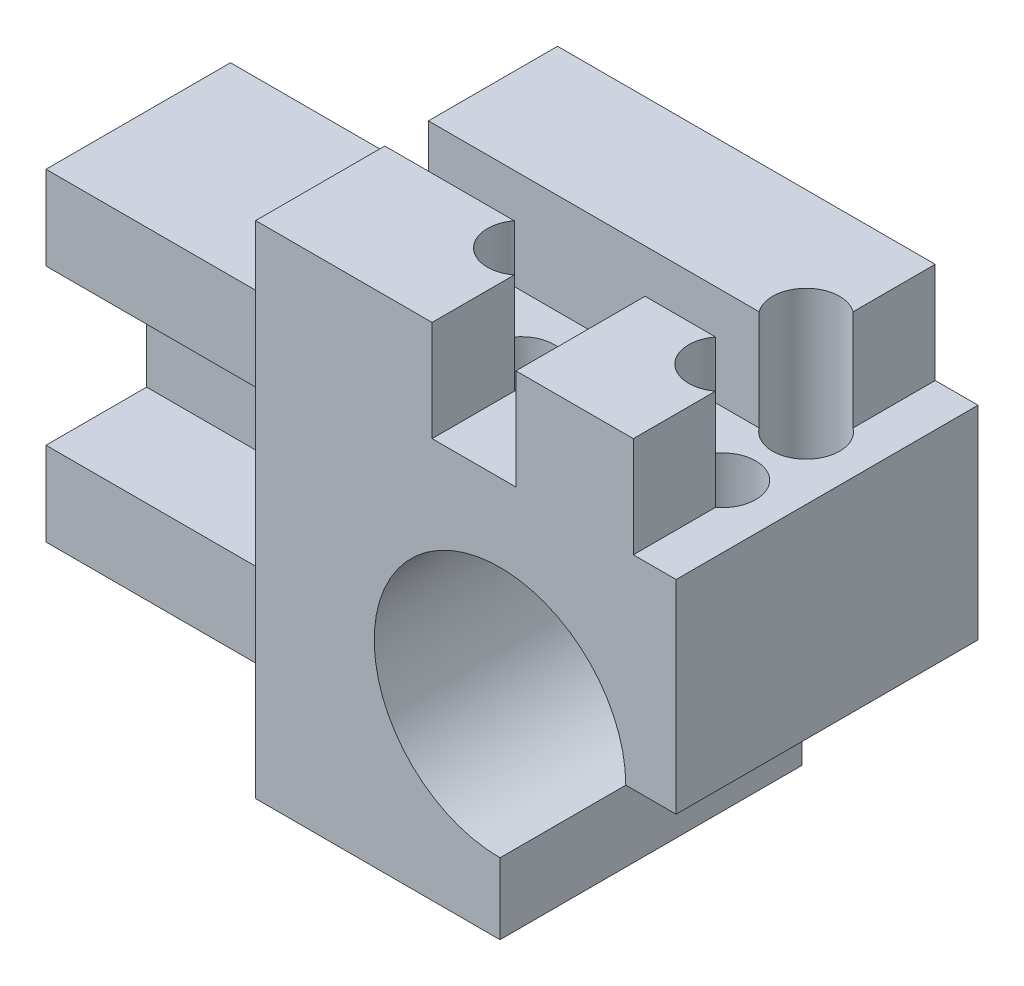
ISO-10303-21;
HEADER;
FILE_DESCRIPTION(('STEP AP214'),'2;1');
FILE_NAME('part.step','',(''),(''),'','','');
FILE_SCHEMA(('AUTOMOTIVE_DESIGN { 1 0 10303 214 1 1 1 1 }'));
ENDSEC;
DATA;
#1=APPLICATION_CONTEXT('core data for automotive mechanical design processes');
#2=APPLICATION_PROTOCOL_DEFINITION('international standard','automotive_design',2000,#1);
#3=PRODUCT_CONTEXT('',#1,'mechanical');
#4=PRODUCT('Part','Part','',(#3));
#5=PRODUCT_RELATED_PRODUCT_CATEGORY('part','',(#4));
#6=PRODUCT_DEFINITION_FORMATION('','',#4);
#7=PRODUCT_DEFINITION_CONTEXT('part definition',#1,'design');
#8=PRODUCT_DEFINITION('design','',#6,#7);
#9=PRODUCT_DEFINITION_SHAPE('','',#8);
#10=(LENGTH_UNIT() NAMED_UNIT(*) SI_UNIT(.MILLI.,.METRE.));
#11=(NAMED_UNIT(*) PLANE_ANGLE_UNIT() SI_UNIT($,.RADIAN.));
#12=(NAMED_UNIT(*) SI_UNIT($,.STERADIAN.) SOLID_ANGLE_UNIT());
#13=UNCERTAINTY_MEASURE_WITH_UNIT(LENGTH_MEASURE(1.E-05),#10,'distance_accuracy_value','');
#14=(GEOMETRIC_REPRESENTATION_CONTEXT(3) GLOBAL_UNCERTAINTY_ASSIGNED_CONTEXT((#13)) GLOBAL_UNIT_ASSIGNED_CONTEXT((#10,
#11,#12)) REPRESENTATION_CONTEXT('',''));
#15=CARTESIAN_POINT('',(0.,0.,0.));
#16=DIRECTION('',(0.,0.,1.));
#17=DIRECTION('',(1.,0.,0.));
#18=AXIS2_PLACEMENT_3D('',#15,#16,#17);
#19=CARTESIAN_POINT('',(-16.5,0.,9.));
#20=DIRECTION('',(1.,0.,0.));
#21=DIRECTION('',(0.,1.,0.));
#22=AXIS2_PLACEMENT_3D('',#19,#20,#21);
#23=PLANE('',#22);
#24=DIRECTION('',(0.,1.,0.));
#25=VECTOR('',#24,1.);
#26=CARTESIAN_POINT('',(-16.5,3.99999999999999,-1.3));
#27=LINE('',#26,#25);
#28=CARTESIAN_POINT('',(-16.5,3.99999999999999,-1.3));
#29=VERTEX_POINT('',#28);
#30=CARTESIAN_POINT('',(-16.5,9.99999999999999,-1.3));
#31=VERTEX_POINT('',#30);
#32=EDGE_CURVE('E358',#29,#31,#27,.T.);
#33=ORIENTED_EDGE('',*,*,#32,.T.);
#34=DIRECTION('',(0.,0.,-1.));
#35=VECTOR('',#34,1.);
#36=CARTESIAN_POINT('',(-16.5,9.99999999999999,9.));
#37=LINE('',#36,#35);
#38=CARTESIAN_POINT('',(-16.5,9.99999999999999,-9.));
#39=VERTEX_POINT('',#38);
#40=EDGE_CURVE('E571',#31,#39,#37,.T.);
#41=ORIENTED_EDGE('',*,*,#40,.T.);
#42=DIRECTION('',(0.,-1.,0.));
#43=VECTOR('',#42,1.);
#44=CARTESIAN_POINT('',(-16.5,0.,-9.));
#45=LINE('',#44,#43);
#46=CARTESIAN_POINT('',(-16.5,-0.600000000000005,-9.));
#47=VERTEX_POINT('',#46);
#48=EDGE_CURVE('E539',#39,#47,#45,.T.);
#49=ORIENTED_EDGE('',*,*,#48,.T.);
#50=DIRECTION('',(0.,0.,-1.));
#51=VECTOR('',#50,1.);
#52=CARTESIAN_POINT('',(-16.5,-0.600000000000005,-4.));
#53=LINE('',#52,#51);
#54=CARTESIAN_POINT('',(-16.5,-0.600000000000005,2.));
#55=VERTEX_POINT('',#54);
#56=EDGE_CURVE('E527',#55,#47,#53,.T.);
#57=ORIENTED_EDGE('',*,*,#56,.F.);
#58=DIRECTION('',(0.,1.,0.));
#59=VECTOR('',#58,1.);
#60=CARTESIAN_POINT('',(-16.5,-0.600000000000005,2.));
#61=LINE('',#60,#59);
#62=CARTESIAN_POINT('',(-16.5,-5.6,2.));
#63=VERTEX_POINT('',#62);
#64=EDGE_CURVE('E470',#63,#55,#61,.T.);
#65=ORIENTED_EDGE('',*,*,#64,.F.);
#66=DIRECTION('',(0.,0.,-1.));
#67=VECTOR('',#66,1.);
#68=CARTESIAN_POINT('',(-16.5,-5.6,2.));
#69=LINE('',#68,#67);
#70=CARTESIAN_POINT('',(-16.5,-5.6,-4.));
#71=VERTEX_POINT('',#70);
#72=EDGE_CURVE('E478',#63,#71,#69,.T.);
#73=ORIENTED_EDGE('',*,*,#72,.T.);
#74=DIRECTION('',(0.,-1.,0.));
#75=VECTOR('',#74,1.);
#76=CARTESIAN_POINT('',(-16.5,-19.85,-4.));
#77=LINE('',#76,#75);
#78=CARTESIAN_POINT('',(-16.5,-14.85,-4.));
#79=VERTEX_POINT('',#78);
#80=EDGE_CURVE('E512',#71,#79,#77,.T.);
#81=ORIENTED_EDGE('',*,*,#80,.T.);
#82=DIRECTION('',(0.,0.,-1.));
#83=VECTOR('',#82,1.);
#84=CARTESIAN_POINT('',(-16.5,-14.85,2.));
#85=LINE('',#84,#83);
#86=CARTESIAN_POINT('',(-16.5,-14.85,2.));
#87=VERTEX_POINT('',#86);
#88=EDGE_CURVE('E507',#87,#79,#85,.T.);
#89=ORIENTED_EDGE('',*,*,#88,.F.);
#90=DIRECTION('',(0.,1.,0.));
#91=VECTOR('',#90,1.);
#92=CARTESIAN_POINT('',(-16.5,-19.85,2.));
#93=LINE('',#92,#91);
#94=CARTESIAN_POINT('',(-16.5,-19.85,2.));
#95=VERTEX_POINT('',#94);
#96=EDGE_CURVE('E495',#95,#87,#93,.T.);
#97=ORIENTED_EDGE('',*,*,#96,.F.);
#98=DIRECTION('',(0.,0.,-1.));
#99=VECTOR('',#98,1.);
#100=CARTESIAN_POINT('',(-16.5,-19.85,9.));
#101=LINE('',#100,#99);
#102=CARTESIAN_POINT('',(-16.5,-19.85,9.));
#103=VERTEX_POINT('',#102);
#104=EDGE_CURVE('E551',#103,#95,#101,.T.);
#105=ORIENTED_EDGE('',*,*,#104,.F.);
#106=DIRECTION('',(0.,-1.,0.));
#107=VECTOR('',#106,1.);
#108=CARTESIAN_POINT('',(-16.5,0.,9.));
#109=LINE('',#108,#107);
#110=CARTESIAN_POINT('',(-16.5,9.99999999999999,9.));
#111=VERTEX_POINT('',#110);
#112=EDGE_CURVE('E548',#111,#103,#109,.T.);
#113=ORIENTED_EDGE('',*,*,#112,.F.);
#114=CARTESIAN_POINT('',(-16.5,9.99999999999999,1.3));
#115=VERTEX_POINT('',#114);
#116=EDGE_CURVE('E572',#111,#115,#37,.T.);
#117=ORIENTED_EDGE('',*,*,#116,.T.);
#118=DIRECTION('',(0.,1.,0.));
#119=VECTOR('',#118,1.);
#120=CARTESIAN_POINT('',(-16.5,3.99999999999999,1.3));
#121=LINE('',#120,#119);
#122=CARTESIAN_POINT('',(-16.5,3.99999999999999,1.3));
#123=VERTEX_POINT('',#122);
#124=EDGE_CURVE('E409',#123,#115,#121,.T.);
#125=ORIENTED_EDGE('',*,*,#124,.F.);
#126=DIRECTION('',(0.,0.,1.));
#127=VECTOR('',#126,1.);
#128=CARTESIAN_POINT('',(-16.5,3.99999999999999,0.));
#129=LINE('',#128,#127);
#130=EDGE_CURVE('E319',#29,#123,#129,.T.);
#131=ORIENTED_EDGE('',*,*,#130,.F.);
#132=EDGE_LOOP('',(#33,#41,#49,#57,#65,#73,#81,#89,#97,#105,#113,#117,#125,#131));
#133=FACE_BOUND('',#132,.T.);
#134=ADVANCED_FACE('F43',(#133),#23,.F.);
#135=CARTESIAN_POINT('',(8.56892000000005,0.,9.));
#136=DIRECTION('',(-1.,0.,0.));
#137=DIRECTION('',(0.,-1.,0.));
#138=AXIS2_PLACEMENT_3D('',#135,#136,#137);
#139=PLANE('',#138);
#140=DIRECTION('',(0.,0.,-1.));
#141=VECTOR('',#140,1.);
#142=CARTESIAN_POINT('',(8.56892000000006,4.,0.));
#143=LINE('',#142,#141);
#144=CARTESIAN_POINT('',(8.56892000000006,4.,9.));
#145=VERTEX_POINT('',#144);
#146=CARTESIAN_POINT('',(8.56892000000006,4.,-9.));
#147=VERTEX_POINT('',#146);
#148=EDGE_CURVE('E348',#145,#147,#143,.T.);
#149=ORIENTED_EDGE('',*,*,#148,.F.);
#150=DIRECTION('',(0.,1.,0.));
#151=VECTOR('',#150,1.);
#152=CARTESIAN_POINT('',(8.56892000000005,0.,9.));
#153=LINE('',#152,#151);
#154=CARTESIAN_POINT('',(8.56892000000005,-8.11891999999998,9.));
#155=VERTEX_POINT('',#154);
#156=EDGE_CURVE('E541',#155,#145,#153,.T.);
#157=ORIENTED_EDGE('',*,*,#156,.F.);
#158=DIRECTION('',(0.,0.,-1.));
#159=VECTOR('',#158,1.);
#160=CARTESIAN_POINT('',(8.56892000000005,-8.11891999999998,9.));
#161=LINE('',#160,#159);
#162=CARTESIAN_POINT('',(8.56892000000005,-8.11891999999998,-9.));
#163=VERTEX_POINT('',#162);
#164=EDGE_CURVE('E576',#155,#163,#161,.T.);
#165=ORIENTED_EDGE('',*,*,#164,.T.);
#166=DIRECTION('',(0.,1.,0.));
#167=VECTOR('',#166,1.);
#168=CARTESIAN_POINT('',(8.56892000000005,0.,-9.));
#169=LINE('',#168,#167);
#170=EDGE_CURVE('E558',#163,#147,#169,.T.);
#171=ORIENTED_EDGE('',*,*,#170,.T.);
#172=EDGE_LOOP('',(#149,#157,#165,#171));
#173=FACE_BOUND('',#172,.T.);
#174=ADVANCED_FACE('F622',(#173),#139,.F.);
#175=CARTESIAN_POINT('',(0.,10.,9.));
#176=DIRECTION('',(0.,-1.,0.));
#177=DIRECTION('',(1.,0.,0.));
#178=AXIS2_PLACEMENT_3D('',#175,#176,#177);
#179=PLANE('',#178);
#180=DIRECTION('',(1.,0.,0.));
#181=VECTOR('',#180,1.);
#182=CARTESIAN_POINT('',(0.,10.,-1.3));
#183=LINE('',#182,#181);
#184=CARTESIAN_POINT('',(3.21892000000001,10.,-1.3));
#185=VERTEX_POINT('',#184);
#186=EDGE_CURVE('E313',#31,#185,#183,.T.);
#187=ORIENTED_EDGE('',*,*,#186,.T.);
#188=CARTESIAN_POINT('',(4.81892000000001,10.,-2.5));
#189=DIRECTION('',(0.,1.,0.));
#190=DIRECTION('',(-1.,0.,0.));
#191=AXIS2_PLACEMENT_3D('',#188,#189,#190);
#192=CIRCLE('',#191,2.);
#193=CARTESIAN_POINT('',(6.01892,10.,-4.1));
#194=VERTEX_POINT('',#193);
#195=EDGE_CURVE('E427',#194,#185,#192,.T.);
#196=ORIENTED_EDGE('',*,*,#195,.F.);
#197=DIRECTION('',(0.,0.,-1.));
#198=VECTOR('',#197,1.);
#199=CARTESIAN_POINT('',(6.01892000000001,10.,0.));
#200=LINE('',#199,#198);
#201=CARTESIAN_POINT('',(6.01892,10.,-9.));
#202=VERTEX_POINT('',#201);
#203=EDGE_CURVE('E320',#194,#202,#200,.T.);
#204=ORIENTED_EDGE('',*,*,#203,.T.);
#205=DIRECTION('',(-1.,0.,0.));
#206=VECTOR('',#205,1.);
#207=CARTESIAN_POINT('',(0.,10.,-9.));
#208=LINE('',#207,#206);
#209=EDGE_CURVE('E561',#202,#39,#208,.T.);
#210=ORIENTED_EDGE('',*,*,#209,.T.);
#211=ORIENTED_EDGE('',*,*,#40,.F.);
#212=EDGE_LOOP('',(#187,#196,#204,#210,#211));
#213=FACE_BOUND('',#212,.T.);
#214=ADVANCED_FACE('F628',(#213),#179,.F.);
#215=DIRECTION('',(0.,0.,-1.));
#216=VECTOR('',#215,1.);
#217=CARTESIAN_POINT('',(6.01892000000001,10.,0.));
#218=LINE('',#217,#216);
#219=CARTESIAN_POINT('',(6.01892,10.,9.));
#220=VERTEX_POINT('',#219);
#221=CARTESIAN_POINT('',(6.01892,10.,4.1));
#222=VERTEX_POINT('',#221);
#223=EDGE_CURVE('E373',#220,#222,#218,.T.);
#224=ORIENTED_EDGE('',*,*,#223,.T.);
#225=CARTESIAN_POINT('',(4.81892000000001,10.,2.5));
#226=DIRECTION('',(0.,1.,0.));
#227=DIRECTION('',(-1.,0.,0.));
#228=AXIS2_PLACEMENT_3D('',#225,#226,#227);
#229=CIRCLE('',#228,2.);
#230=CARTESIAN_POINT('',(3.21892000000001,10.,1.3));
#231=VERTEX_POINT('',#230);
#232=EDGE_CURVE('E380',#231,#222,#229,.T.);
#233=ORIENTED_EDGE('',*,*,#232,.F.);
#234=DIRECTION('',(1.,0.,0.));
#235=VECTOR('',#234,1.);
#236=CARTESIAN_POINT('',(0.,10.,1.3));
#237=LINE('',#236,#235);
#238=CARTESIAN_POINT('',(-0.981079999999992,10.,1.3));
#239=VERTEX_POINT('',#238);
#240=EDGE_CURVE('E371',#239,#231,#237,.T.);
#241=ORIENTED_EDGE('',*,*,#240,.F.);
#242=DIRECTION('',(0.,0.,-1.));
#243=VECTOR('',#242,1.);
#244=CARTESIAN_POINT('',(-0.981079999999992,10.,0.));
#245=LINE('',#244,#243);
#246=CARTESIAN_POINT('',(-0.981079999999994,10.,9.));
#247=VERTEX_POINT('',#246);
#248=EDGE_CURVE('E368',#247,#239,#245,.T.);
#249=ORIENTED_EDGE('',*,*,#248,.F.);
#250=DIRECTION('',(-1.,0.,0.));
#251=VECTOR('',#250,1.);
#252=CARTESIAN_POINT('',(0.,10.,9.));
#253=LINE('',#252,#251);
#254=EDGE_CURVE('E547',#220,#247,#253,.T.);
#255=ORIENTED_EDGE('',*,*,#254,.F.);
#256=EDGE_LOOP('',(#224,#233,#241,#249,#255));
#257=FACE_BOUND('',#256,.T.);
#258=ADVANCED_FACE('F639',(#257),#179,.F.);
#259=CARTESIAN_POINT('',(0.,0.,9.));
#260=DIRECTION('',(0.,0.,1.));
#261=DIRECTION('',(1.,0.,0.));
#262=AXIS2_PLACEMENT_3D('',#259,#260,#261);
#263=PLANE('',#262);
#264=CARTESIAN_POINT('',(-1.93107999999995,-8.11892000000002,9.));
#265=DIRECTION('',(0.,0.,1.));
#266=DIRECTION('',(1.,0.,0.));
#267=AXIS2_PLACEMENT_3D('',#264,#265,#266);
#268=CIRCLE('',#267,7.5);
#269=CARTESIAN_POINT('',(5.56892000000005,-8.11892000000002,9.));
#270=VERTEX_POINT('',#269);
#271=CARTESIAN_POINT('',(-1.93107999999995,-15.61892,9.));
#272=VERTEX_POINT('',#271);
#273=EDGE_CURVE('E294',#270,#272,#268,.T.);
#274=ORIENTED_EDGE('',*,*,#273,.F.);
#275=DIRECTION('',(-1.,0.,0.));
#276=VECTOR('',#275,1.);
#277=CARTESIAN_POINT('',(0.,-8.11891999999998,9.));
#278=LINE('',#277,#276);
#279=EDGE_CURVE('E538',#155,#270,#278,.T.);
#280=ORIENTED_EDGE('',*,*,#279,.F.);
#281=ORIENTED_EDGE('',*,*,#156,.T.);
#282=DIRECTION('',(1.,0.,0.));
#283=VECTOR('',#282,1.);
#284=CARTESIAN_POINT('',(0.,4.,9.));
#285=LINE('',#284,#283);
#286=CARTESIAN_POINT('',(6.01892,4.,9.));
#287=VERTEX_POINT('',#286);
#288=EDGE_CURVE('E337',#287,#145,#285,.T.);
#289=ORIENTED_EDGE('',*,*,#288,.F.);
#290=DIRECTION('',(0.,1.,0.));
#291=VECTOR('',#290,1.);
#292=CARTESIAN_POINT('',(6.01892,4.,9.));
#293=LINE('',#292,#291);
#294=EDGE_CURVE('E386',#287,#220,#293,.T.);
#295=ORIENTED_EDGE('',*,*,#294,.T.);
#296=ORIENTED_EDGE('',*,*,#254,.T.);
#297=DIRECTION('',(0.,1.,0.));
#298=VECTOR('',#297,1.);
#299=CARTESIAN_POINT('',(-0.981079999999993,4.,9.));
#300=LINE('',#299,#298);
#301=CARTESIAN_POINT('',(-0.981079999999993,4.,9.));
#302=VERTEX_POINT('',#301);
#303=EDGE_CURVE('E396',#302,#247,#300,.T.);
#304=ORIENTED_EDGE('',*,*,#303,.F.);
#305=CARTESIAN_POINT('',(-5.98107999999999,4.,9.));
#306=VERTEX_POINT('',#305);
#307=EDGE_CURVE('E332',#306,#302,#285,.T.);
#308=ORIENTED_EDGE('',*,*,#307,.F.);
#309=DIRECTION('',(0.,1.,0.));
#310=VECTOR('',#309,1.);
#311=CARTESIAN_POINT('',(-5.98107999999999,4.,9.));
#312=LINE('',#311,#310);
#313=CARTESIAN_POINT('',(-5.98107999999999,10.,9.));
#314=VERTEX_POINT('',#313);
#315=EDGE_CURVE('E398',#306,#314,#312,.T.);
#316=ORIENTED_EDGE('',*,*,#315,.T.);
#317=EDGE_CURVE('E544',#314,#111,#253,.T.);
#318=ORIENTED_EDGE('',*,*,#317,.T.);
#319=ORIENTED_EDGE('',*,*,#112,.T.);
#320=DIRECTION('',(1.,0.,0.));
#321=VECTOR('',#320,1.);
#322=CARTESIAN_POINT('',(0.,-19.85,9.));
#323=LINE('',#322,#321);
#324=CARTESIAN_POINT('',(-1.93107999999995,-19.85,9.));
#325=VERTEX_POINT('',#324);
#326=EDGE_CURVE('E305',#103,#325,#323,.T.);
#327=ORIENTED_EDGE('',*,*,#326,.T.);
#328=DIRECTION('',(0.,-1.,0.));
#329=VECTOR('',#328,1.);
#330=CARTESIAN_POINT('',(-1.93107999999995,0.,9.));
#331=LINE('',#330,#329);
#332=EDGE_CURVE('E286',#272,#325,#331,.T.);
#333=ORIENTED_EDGE('',*,*,#332,.F.);
#334=EDGE_LOOP('',(#274,#280,#281,#289,#295,#296,#304,#308,#316,#318,#319,#327,#333));
#335=FACE_BOUND('',#334,.T.);
#336=ADVANCED_FACE('F303',(#335),#263,.T.);
#337=CARTESIAN_POINT('',(0.,0.,-9.));
#338=DIRECTION('',(0.,0.,1.));
#339=DIRECTION('',(1.,0.,0.));
#340=AXIS2_PLACEMENT_3D('',#337,#338,#339);
#341=PLANE('',#340);
#342=DIRECTION('',(-1.,0.,0.));
#343=VECTOR('',#342,1.);
#344=CARTESIAN_POINT('',(0.,-8.475,-9.));
#345=LINE('',#344,#343);
#346=CARTESIAN_POINT('',(-26.,-8.475,-9.));
#347=VERTEX_POINT('',#346);
#348=CARTESIAN_POINT('',(-28.,-8.475,-9.));
#349=VERTEX_POINT('',#348);
#350=EDGE_CURVE('E52',#347,#349,#345,.T.);
#351=ORIENTED_EDGE('',*,*,#350,.T.);
#352=CARTESIAN_POINT('',(-28.,-10.225,-9.));
#353=DIRECTION('',(0.,0.,1.));
#354=DIRECTION('',(1.,0.,0.));
#355=AXIS2_PLACEMENT_3D('',#352,#353,#354);
#356=CIRCLE('',#355,1.75);
#357=CARTESIAN_POINT('',(-28.,-11.975,-9.));
#358=VERTEX_POINT('',#357);
#359=EDGE_CURVE('E11',#349,#358,#356,.T.);
#360=ORIENTED_EDGE('',*,*,#359,.T.);
#361=DIRECTION('',(1.,0.,0.));
#362=VECTOR('',#361,1.);
#363=CARTESIAN_POINT('',(0.,-11.975,-9.));
#364=LINE('',#363,#362);
#365=CARTESIAN_POINT('',(-26.,-11.975,-9.));
#366=VERTEX_POINT('',#365);
#367=EDGE_CURVE('E578',#358,#366,#364,.T.);
#368=ORIENTED_EDGE('',*,*,#367,.T.);
#369=CARTESIAN_POINT('',(-26.,-10.225,-9.));
#370=DIRECTION('',(0.,0.,1.));
#371=DIRECTION('',(1.,0.,0.));
#372=AXIS2_PLACEMENT_3D('',#369,#370,#371);
#373=CIRCLE('',#372,1.75);
#374=EDGE_CURVE('E582',#366,#347,#373,.T.);
#375=ORIENTED_EDGE('',*,*,#374,.T.);
#376=EDGE_LOOP('',(#351,#360,#368,#375));
#377=FACE_BOUND('',#376,.T.);
#378=DIRECTION('',(-1.,0.,0.));
#379=VECTOR('',#378,1.);
#380=CARTESIAN_POINT('',(0.,-8.11891999999998,-9.));
#381=LINE('',#380,#379);
#382=CARTESIAN_POINT('',(5.56892000000005,-8.11891999999998,-9.));
#383=VERTEX_POINT('',#382);
#384=EDGE_CURVE('E555',#163,#383,#381,.T.);
#385=ORIENTED_EDGE('',*,*,#384,.T.);
#386=CARTESIAN_POINT('',(-1.93107999999995,-8.11892000000002,-9.));
#387=DIRECTION('',(0.,0.,1.));
#388=DIRECTION('',(1.,0.,0.));
#389=AXIS2_PLACEMENT_3D('',#386,#387,#388);
#390=CIRCLE('',#389,7.5);
#391=CARTESIAN_POINT('',(-1.93107999999995,-15.61892,-9.));
#392=VERTEX_POINT('',#391);
#393=EDGE_CURVE('E59',#383,#392,#390,.T.);
#394=ORIENTED_EDGE('',*,*,#393,.T.);
#395=DIRECTION('',(0.,-1.,0.));
#396=VECTOR('',#395,1.);
#397=CARTESIAN_POINT('',(-1.93107999999995,0.,-9.));
#398=LINE('',#397,#396);
#399=CARTESIAN_POINT('',(-1.93107999999995,-19.85,-9.));
#400=VERTEX_POINT('',#399);
#401=EDGE_CURVE('E289',#392,#400,#398,.T.);
#402=ORIENTED_EDGE('',*,*,#401,.T.);
#403=DIRECTION('',(1.,0.,0.));
#404=VECTOR('',#403,1.);
#405=CARTESIAN_POINT('',(0.,-19.85,-9.));
#406=LINE('',#405,#404);
#407=CARTESIAN_POINT('',(-36.,-19.85,-9.));
#408=VERTEX_POINT('',#407);
#409=EDGE_CURVE('E530',#408,#400,#406,.T.);
#410=ORIENTED_EDGE('',*,*,#409,.F.);
#411=DIRECTION('',(0.,1.,0.));
#412=VECTOR('',#411,1.);
#413=CARTESIAN_POINT('',(-36.,-19.85,-9.));
#414=LINE('',#413,#412);
#415=CARTESIAN_POINT('',(-36.,-0.600000000000005,-9.));
#416=VERTEX_POINT('',#415);
#417=EDGE_CURVE('E511',#408,#416,#414,.T.);
#418=ORIENTED_EDGE('',*,*,#417,.T.);
#419=DIRECTION('',(1.,0.,0.));
#420=VECTOR('',#419,1.);
#421=CARTESIAN_POINT('',(-16.5,-0.600000000000005,-9.));
#422=LINE('',#421,#420);
#423=EDGE_CURVE('E516',#416,#47,#422,.T.);
#424=ORIENTED_EDGE('',*,*,#423,.T.);
#425=ORIENTED_EDGE('',*,*,#48,.F.);
#426=ORIENTED_EDGE('',*,*,#209,.F.);
#427=DIRECTION('',(0.,1.,0.));
#428=VECTOR('',#427,1.);
#429=CARTESIAN_POINT('',(6.01892,4.,-9.));
#430=LINE('',#429,#428);
#431=CARTESIAN_POINT('',(6.01892,4.,-9.));
#432=VERTEX_POINT('',#431);
#433=EDGE_CURVE('E384',#432,#202,#430,.T.);
#434=ORIENTED_EDGE('',*,*,#433,.F.);
#435=DIRECTION('',(-1.,0.,0.));
#436=VECTOR('',#435,1.);
#437=CARTESIAN_POINT('',(0.,4.,-9.));
#438=LINE('',#437,#436);
#439=EDGE_CURVE('E350',#147,#432,#438,.T.);
#440=ORIENTED_EDGE('',*,*,#439,.F.);
#441=ORIENTED_EDGE('',*,*,#170,.F.);
#442=EDGE_LOOP('',(#385,#394,#402,#410,#418,#424,#425,#426,#434,#440,#441));
#443=FACE_BOUND('',#442,.T.);
#444=ADVANCED_FACE('F588',(#377,#443),#341,.F.);
#445=CARTESIAN_POINT('',(4.81892000000001,0.,2.5));
#446=DIRECTION('',(0.,1.,0.));
#447=DIRECTION('',(-1.,0.,0.));
#448=AXIS2_PLACEMENT_3D('',#445,#446,#447);
#449=CYLINDRICAL_SURFACE('',#448,2.);
#450=CARTESIAN_POINT('',(4.81892000000001,0.,2.5));
#451=DIRECTION('',(0.,1.,0.));
#452=DIRECTION('',(-1.,0.,0.));
#453=AXIS2_PLACEMENT_3D('',#450,#451,#452);
#454=CIRCLE('',#453,2.);
#455=CARTESIAN_POINT('',(2.81892000000001,0.,2.5));
#456=VERTEX_POINT('',#455);
#457=EDGE_CURVE('E430',#456,#456,#454,.T.);
#458=ORIENTED_EDGE('',*,*,#457,.F.);
#459=EDGE_LOOP('',(#458));
#460=FACE_BOUND('',#459,.T.);
#461=DIRECTION('',(0.,1.,0.));
#462=VECTOR('',#461,1.);
#463=CARTESIAN_POINT('',(6.01892000000001,4.,4.1));
#464=LINE('',#463,#462);
#465=CARTESIAN_POINT('',(6.01892000000001,4.,4.1));
#466=VERTEX_POINT('',#465);
#467=EDGE_CURVE('E389',#466,#222,#464,.T.);
#468=ORIENTED_EDGE('',*,*,#467,.F.);
#469=CARTESIAN_POINT('',(4.81892000000001,4.,2.5));
#470=DIRECTION('',(0.,1.,0.));
#471=DIRECTION('',(-1.,0.,0.));
#472=AXIS2_PLACEMENT_3D('',#469,#470,#471);
#473=CIRCLE('',#472,2.);
#474=CARTESIAN_POINT('',(3.21892000000001,4.,1.3));
#475=VERTEX_POINT('',#474);
#476=EDGE_CURVE('E343',#475,#466,#473,.F.);
#477=ORIENTED_EDGE('',*,*,#476,.F.);
#478=DIRECTION('',(0.,1.,0.));
#479=VECTOR('',#478,1.);
#480=CARTESIAN_POINT('',(3.21892000000001,4.,1.3));
#481=LINE('',#480,#479);
#482=EDGE_CURVE('E391',#475,#231,#481,.T.);
#483=ORIENTED_EDGE('',*,*,#482,.T.);
#484=ORIENTED_EDGE('',*,*,#232,.T.);
#485=EDGE_LOOP('',(#468,#477,#483,#484));
#486=FACE_BOUND('',#485,.T.);
#487=ADVANCED_FACE('F667',(#460,#486),#449,.F.);
#488=CARTESIAN_POINT('',(4.81892000000001,0.,-2.5));
#489=DIRECTION('',(0.,1.,0.));
#490=DIRECTION('',(-1.,0.,0.));
#491=AXIS2_PLACEMENT_3D('',#488,#489,#490);
#492=CYLINDRICAL_SURFACE('',#491,2.);
#493=CARTESIAN_POINT('',(4.81892000000001,0.,-2.5));
#494=DIRECTION('',(0.,1.,0.));
#495=DIRECTION('',(-1.,0.,0.));
#496=AXIS2_PLACEMENT_3D('',#493,#494,#495);
#497=CIRCLE('',#496,2.);
#498=CARTESIAN_POINT('',(2.81892000000001,0.,-2.5));
#499=VERTEX_POINT('',#498);
#500=EDGE_CURVE('E424',#499,#499,#497,.T.);
#501=ORIENTED_EDGE('',*,*,#500,.F.);
#502=EDGE_LOOP('',(#501));
#503=FACE_BOUND('',#502,.T.);
#504=DIRECTION('',(0.,1.,0.));
#505=VECTOR('',#504,1.);
#506=CARTESIAN_POINT('',(3.21892000000001,4.,-1.3));
#507=LINE('',#506,#505);
#508=CARTESIAN_POINT('',(3.21892000000001,4.,-1.3));
#509=VERTEX_POINT('',#508);
#510=EDGE_CURVE('E378',#509,#185,#507,.T.);
#511=ORIENTED_EDGE('',*,*,#510,.F.);
#512=CARTESIAN_POINT('',(4.81892000000001,4.,-2.5));
#513=DIRECTION('',(0.,1.,0.));
#514=DIRECTION('',(-1.,0.,0.));
#515=AXIS2_PLACEMENT_3D('',#512,#513,#514);
#516=CIRCLE('',#515,2.);
#517=CARTESIAN_POINT('',(6.01892000000001,4.,-4.1));
#518=VERTEX_POINT('',#517);
#519=EDGE_CURVE('E355',#518,#509,#516,.F.);
#520=ORIENTED_EDGE('',*,*,#519,.F.);
#521=DIRECTION('',(0.,1.,0.));
#522=VECTOR('',#521,1.);
#523=CARTESIAN_POINT('',(6.01892000000001,4.,-4.1));
#524=LINE('',#523,#522);
#525=EDGE_CURVE('E381',#518,#194,#524,.T.);
#526=ORIENTED_EDGE('',*,*,#525,.T.);
#527=ORIENTED_EDGE('',*,*,#195,.T.);
#528=EDGE_LOOP('',(#511,#520,#526,#527));
#529=FACE_BOUND('',#528,.T.);
#530=ADVANCED_FACE('F712',(#503,#529),#492,.F.);
#531=CARTESIAN_POINT('',(0.,0.,-4.));
#532=DIRECTION('',(0.,0.,1.));
#533=DIRECTION('',(1.,0.,0.));
#534=AXIS2_PLACEMENT_3D('',#531,#532,#533);
#535=PLANE('',#534);
#536=CARTESIAN_POINT('',(-28.,-10.225,-4.));
#537=DIRECTION('',(0.,0.,1.));
#538=DIRECTION('',(1.,0.,0.));
#539=AXIS2_PLACEMENT_3D('',#536,#537,#538);
#540=CIRCLE('',#539,1.75);
#541=CARTESIAN_POINT('',(-28.,-8.475,-4.));
#542=VERTEX_POINT('',#541);
#543=CARTESIAN_POINT('',(-28.,-11.975,-4.));
#544=VERTEX_POINT('',#543);
#545=EDGE_CURVE('E419',#542,#544,#540,.T.);
#546=ORIENTED_EDGE('',*,*,#545,.F.);
#547=DIRECTION('',(-1.,0.,0.));
#548=VECTOR('',#547,1.);
#549=CARTESIAN_POINT('',(-28.,-8.475,-4.));
#550=LINE('',#549,#548);
#551=CARTESIAN_POINT('',(-26.,-8.475,-4.));
#552=VERTEX_POINT('',#551);
#553=EDGE_CURVE('E445',#552,#542,#550,.T.);
#554=ORIENTED_EDGE('',*,*,#553,.F.);
#555=CARTESIAN_POINT('',(-26.,-10.225,-4.));
#556=DIRECTION('',(0.,0.,1.));
#557=DIRECTION('',(1.,0.,0.));
#558=AXIS2_PLACEMENT_3D('',#555,#556,#557);
#559=CIRCLE('',#558,1.75);
#560=CARTESIAN_POINT('',(-26.,-11.975,-4.));
#561=VERTEX_POINT('',#560);
#562=EDGE_CURVE('E441',#561,#552,#559,.T.);
#563=ORIENTED_EDGE('',*,*,#562,.F.);
#564=DIRECTION('',(1.,0.,0.));
#565=VECTOR('',#564,1.);
#566=CARTESIAN_POINT('',(-28.,-11.975,-4.));
#567=LINE('',#566,#565);
#568=EDGE_CURVE('E437',#544,#561,#567,.T.);
#569=ORIENTED_EDGE('',*,*,#568,.F.);
#570=EDGE_LOOP('',(#546,#554,#563,#569));
#571=FACE_BOUND('',#570,.T.);
#572=ORIENTED_EDGE('',*,*,#80,.F.);
#573=DIRECTION('',(1.,0.,0.));
#574=VECTOR('',#573,1.);
#575=CARTESIAN_POINT('',(-36.,-5.6,-4.));
#576=LINE('',#575,#574);
#577=CARTESIAN_POINT('',(-36.,-5.6,-4.));
#578=VERTEX_POINT('',#577);
#579=EDGE_CURVE('E453',#578,#71,#576,.T.);
#580=ORIENTED_EDGE('',*,*,#579,.F.);
#581=DIRECTION('',(0.,1.,0.));
#582=VECTOR('',#581,1.);
#583=CARTESIAN_POINT('',(-36.,-19.85,-4.));
#584=LINE('',#583,#582);
#585=CARTESIAN_POINT('',(-36.,-14.85,-4.));
#586=VERTEX_POINT('',#585);
#587=EDGE_CURVE('E515',#586,#578,#584,.T.);
#588=ORIENTED_EDGE('',*,*,#587,.F.);
#589=DIRECTION('',(-1.,0.,0.));
#590=VECTOR('',#589,1.);
#591=CARTESIAN_POINT('',(-36.,-14.85,-4.));
#592=LINE('',#591,#590);
#593=EDGE_CURVE('E487',#79,#586,#592,.T.);
#594=ORIENTED_EDGE('',*,*,#593,.F.);
#595=EDGE_LOOP('',(#572,#580,#588,#594));
#596=FACE_BOUND('',#595,.T.);
#597=ADVANCED_FACE('F602',(#571,#596),#535,.T.);
#598=CARTESIAN_POINT('',(0.,-19.85,9.));
#599=DIRECTION('',(0.,1.,0.));
#600=DIRECTION('',(0.,0.,1.));
#601=AXIS2_PLACEMENT_3D('',#598,#599,#600);
#602=PLANE('',#601);
#603=ORIENTED_EDGE('',*,*,#409,.T.);
#604=DIRECTION('',(0.,0.,1.));
#605=VECTOR('',#604,1.);
#606=CARTESIAN_POINT('',(-1.93107999999995,-19.85,-9.));
#607=LINE('',#606,#605);
#608=EDGE_CURVE('E291',#400,#325,#607,.T.);
#609=ORIENTED_EDGE('',*,*,#608,.T.);
#610=ORIENTED_EDGE('',*,*,#326,.F.);
#611=ORIENTED_EDGE('',*,*,#104,.T.);
#612=DIRECTION('',(1.,0.,0.));
#613=VECTOR('',#612,1.);
#614=CARTESIAN_POINT('',(-36.,-19.85,2.));
#615=LINE('',#614,#613);
#616=CARTESIAN_POINT('',(-36.,-19.85,2.));
#617=VERTEX_POINT('',#616);
#618=EDGE_CURVE('E492',#617,#95,#615,.T.);
#619=ORIENTED_EDGE('',*,*,#618,.F.);
#620=DIRECTION('',(0.,0.,-1.));
#621=VECTOR('',#620,1.);
#622=CARTESIAN_POINT('',(-36.,-19.85,-4.));
#623=LINE('',#622,#621);
#624=EDGE_CURVE('E520',#617,#408,#623,.T.);
#625=ORIENTED_EDGE('',*,*,#624,.T.);
#626=EDGE_LOOP('',(#603,#609,#610,#611,#619,#625));
#627=FACE_BOUND('',#626,.T.);
#628=ADVANCED_FACE('F45',(#627),#602,.F.);
#629=CARTESIAN_POINT('',(0.,-8.11891999999998,9.));
#630=DIRECTION('',(0.,-1.,0.));
#631=DIRECTION('',(0.,0.,-1.));
#632=AXIS2_PLACEMENT_3D('',#629,#630,#631);
#633=PLANE('',#632);
#634=DIRECTION('',(0.,0.,1.));
#635=VECTOR('',#634,1.);
#636=CARTESIAN_POINT('',(5.56892000000005,-8.11892000000002,-9.));
#637=LINE('',#636,#635);
#638=EDGE_CURVE('E296',#383,#270,#637,.T.);
#639=ORIENTED_EDGE('',*,*,#638,.F.);
#640=ORIENTED_EDGE('',*,*,#384,.F.);
#641=ORIENTED_EDGE('',*,*,#164,.F.);
#642=ORIENTED_EDGE('',*,*,#279,.T.);
#643=EDGE_LOOP('',(#639,#640,#641,#642));
#644=FACE_BOUND('',#643,.T.);
#645=ADVANCED_FACE('F637',(#644),#633,.T.);
#646=ORIENTED_EDGE('',*,*,#317,.F.);
#647=DIRECTION('',(0.,0.,1.));
#648=VECTOR('',#647,1.);
#649=CARTESIAN_POINT('',(-5.98107999999999,10.,0.));
#650=LINE('',#649,#648);
#651=CARTESIAN_POINT('',(-5.98107999999999,9.99999999999999,4.10000000000001));
#652=VERTEX_POINT('',#651);
#653=EDGE_CURVE('E365',#652,#314,#650,.T.);
#654=ORIENTED_EDGE('',*,*,#653,.F.);
#655=CARTESIAN_POINT('',(-7.18107999999999,9.99999999999999,2.5));
#656=DIRECTION('',(0.,1.,0.));
#657=DIRECTION('',(-1.,0.,0.));
#658=AXIS2_PLACEMENT_3D('',#655,#656,#657);
#659=CIRCLE('',#658,2.);
#660=CARTESIAN_POINT('',(-8.78107999999999,9.99999999999999,1.3));
#661=VERTEX_POINT('',#660);
#662=EDGE_CURVE('E420',#661,#652,#659,.T.);
#663=ORIENTED_EDGE('',*,*,#662,.F.);
#664=DIRECTION('',(1.,0.,0.));
#665=VECTOR('',#664,1.);
#666=CARTESIAN_POINT('',(0.,10.,1.3));
#667=LINE('',#666,#665);
#668=EDGE_CURVE('E362',#115,#661,#667,.T.);
#669=ORIENTED_EDGE('',*,*,#668,.F.);
#670=ORIENTED_EDGE('',*,*,#116,.F.);
#671=EDGE_LOOP('',(#646,#654,#663,#669,#670));
#672=FACE_BOUND('',#671,.T.);
#673=ADVANCED_FACE('F634',(#672),#179,.F.);
#674=CARTESIAN_POINT('',(-16.5,-0.600000000000005,-4.));
#675=DIRECTION('',(0.,1.,0.));
#676=DIRECTION('',(0.,0.,1.));
#677=AXIS2_PLACEMENT_3D('',#674,#675,#676);
#678=PLANE('',#677);
#679=ORIENTED_EDGE('',*,*,#423,.F.);
#680=DIRECTION('',(0.,0.,-1.));
#681=VECTOR('',#680,1.);
#682=CARTESIAN_POINT('',(-36.,-0.600000000000005,-4.));
#683=LINE('',#682,#681);
#684=CARTESIAN_POINT('',(-36.,-0.600000000000005,2.));
#685=VERTEX_POINT('',#684);
#686=EDGE_CURVE('E531',#685,#416,#683,.T.);
#687=ORIENTED_EDGE('',*,*,#686,.F.);
#688=DIRECTION('',(-1.,0.,0.));
#689=VECTOR('',#688,1.);
#690=CARTESIAN_POINT('',(-36.,-0.600000000000005,2.));
#691=LINE('',#690,#689);
#692=EDGE_CURVE('E474',#55,#685,#691,.T.);
#693=ORIENTED_EDGE('',*,*,#692,.F.);
#694=ORIENTED_EDGE('',*,*,#56,.T.);
#695=EDGE_LOOP('',(#679,#687,#693,#694));
#696=FACE_BOUND('',#695,.T.);
#697=ADVANCED_FACE('F636',(#696),#678,.T.);
#698=CARTESIAN_POINT('',(-36.,-19.85,-4.));
#699=DIRECTION('',(-1.,0.,0.));
#700=DIRECTION('',(0.,0.,1.));
#701=AXIS2_PLACEMENT_3D('',#698,#699,#700);
#702=PLANE('',#701);
#703=ORIENTED_EDGE('',*,*,#417,.F.);
#704=ORIENTED_EDGE('',*,*,#624,.F.);
#705=DIRECTION('',(0.,-1.,0.));
#706=VECTOR('',#705,1.);
#707=CARTESIAN_POINT('',(-36.,-19.85,2.));
#708=LINE('',#707,#706);
#709=CARTESIAN_POINT('',(-36.,-14.85,2.));
#710=VERTEX_POINT('',#709);
#711=EDGE_CURVE('E488',#710,#617,#708,.T.);
#712=ORIENTED_EDGE('',*,*,#711,.F.);
#713=DIRECTION('',(0.,0.,-1.));
#714=VECTOR('',#713,1.);
#715=CARTESIAN_POINT('',(-36.,-14.85,2.));
#716=LINE('',#715,#714);
#717=EDGE_CURVE('E501',#710,#586,#716,.T.);
#718=ORIENTED_EDGE('',*,*,#717,.T.);
#719=ORIENTED_EDGE('',*,*,#587,.T.);
#720=DIRECTION('',(0.,0.,-1.));
#721=VECTOR('',#720,1.);
#722=CARTESIAN_POINT('',(-36.,-5.6,2.));
#723=LINE('',#722,#721);
#724=CARTESIAN_POINT('',(-36.,-5.6,2.));
#725=VERTEX_POINT('',#724);
#726=EDGE_CURVE('E484',#725,#578,#723,.T.);
#727=ORIENTED_EDGE('',*,*,#726,.F.);
#728=DIRECTION('',(0.,-1.,0.));
#729=VECTOR('',#728,1.);
#730=CARTESIAN_POINT('',(-36.,-0.600000000000005,2.));
#731=LINE('',#730,#729);
#732=EDGE_CURVE('E463',#685,#725,#731,.T.);
#733=ORIENTED_EDGE('',*,*,#732,.F.);
#734=ORIENTED_EDGE('',*,*,#686,.T.);
#735=EDGE_LOOP('',(#703,#704,#712,#718,#719,#727,#733,#734));
#736=FACE_BOUND('',#735,.T.);
#737=ADVANCED_FACE('F691',(#736),#702,.T.);
#738=CARTESIAN_POINT('',(-36.,-14.85,2.));
#739=DIRECTION('',(0.,-1.,0.));
#740=DIRECTION('',(0.,0.,-1.));
#741=AXIS2_PLACEMENT_3D('',#738,#739,#740);
#742=PLANE('',#741);
#743=ORIENTED_EDGE('',*,*,#593,.T.);
#744=ORIENTED_EDGE('',*,*,#717,.F.);
#745=DIRECTION('',(-1.,0.,0.));
#746=VECTOR('',#745,1.);
#747=CARTESIAN_POINT('',(-36.,-14.85,2.));
#748=LINE('',#747,#746);
#749=EDGE_CURVE('E498',#87,#710,#748,.T.);
#750=ORIENTED_EDGE('',*,*,#749,.F.);
#751=ORIENTED_EDGE('',*,*,#88,.T.);
#752=EDGE_LOOP('',(#743,#744,#750,#751));
#753=FACE_BOUND('',#752,.T.);
#754=ADVANCED_FACE('F767',(#753),#742,.F.);
#755=CARTESIAN_POINT('',(0.,0.,2.));
#756=DIRECTION('',(0.,0.,-1.));
#757=DIRECTION('',(-1.,0.,0.));
#758=AXIS2_PLACEMENT_3D('',#755,#756,#757);
#759=PLANE('',#758);
#760=ORIENTED_EDGE('',*,*,#711,.T.);
#761=ORIENTED_EDGE('',*,*,#618,.T.);
#762=ORIENTED_EDGE('',*,*,#96,.T.);
#763=ORIENTED_EDGE('',*,*,#749,.T.);
#764=EDGE_LOOP('',(#760,#761,#762,#763));
#765=FACE_BOUND('',#764,.T.);
#766=ADVANCED_FACE('F763',(#765),#759,.F.);
#767=CARTESIAN_POINT('',(-36.,-5.6,2.));
#768=DIRECTION('',(0.,1.,0.));
#769=DIRECTION('',(0.,0.,1.));
#770=AXIS2_PLACEMENT_3D('',#767,#768,#769);
#771=PLANE('',#770);
#772=ORIENTED_EDGE('',*,*,#579,.T.);
#773=ORIENTED_EDGE('',*,*,#72,.F.);
#774=DIRECTION('',(1.,0.,0.));
#775=VECTOR('',#774,1.);
#776=CARTESIAN_POINT('',(-36.,-5.6,2.));
#777=LINE('',#776,#775);
#778=EDGE_CURVE('E467',#725,#63,#777,.T.);
#779=ORIENTED_EDGE('',*,*,#778,.F.);
#780=ORIENTED_EDGE('',*,*,#726,.T.);
#781=EDGE_LOOP('',(#772,#773,#779,#780));
#782=FACE_BOUND('',#781,.T.);
#783=ADVANCED_FACE('F758',(#782),#771,.F.);
#784=CARTESIAN_POINT('',(0.,0.,2.));
#785=DIRECTION('',(0.,0.,1.));
#786=DIRECTION('',(1.,0.,0.));
#787=AXIS2_PLACEMENT_3D('',#784,#785,#786);
#788=PLANE('',#787);
#789=ORIENTED_EDGE('',*,*,#732,.T.);
#790=ORIENTED_EDGE('',*,*,#778,.T.);
#791=ORIENTED_EDGE('',*,*,#64,.T.);
#792=ORIENTED_EDGE('',*,*,#692,.T.);
#793=EDGE_LOOP('',(#789,#790,#791,#792));
#794=FACE_BOUND('',#793,.T.);
#795=ADVANCED_FACE('F697',(#794),#788,.T.);
#796=CARTESIAN_POINT('',(-28.,-10.225,-10.));
#797=DIRECTION('',(0.,0.,1.));
#798=DIRECTION('',(1.,0.,0.));
#799=AXIS2_PLACEMENT_3D('',#796,#797,#798);
#800=CYLINDRICAL_SURFACE('',#799,1.75);
#801=DIRECTION('',(0.,0.,1.));
#802=VECTOR('',#801,1.);
#803=CARTESIAN_POINT('',(-28.,-8.475,-10.));
#804=LINE('',#803,#802);
#805=EDGE_CURVE('E450',#349,#542,#804,.T.);
#806=ORIENTED_EDGE('',*,*,#805,.T.);
#807=ORIENTED_EDGE('',*,*,#545,.T.);
#808=DIRECTION('',(0.,0.,1.));
#809=VECTOR('',#808,1.);
#810=CARTESIAN_POINT('',(-28.,-11.975,-10.));
#811=LINE('',#810,#809);
#812=EDGE_CURVE('E449',#358,#544,#811,.T.);
#813=ORIENTED_EDGE('',*,*,#812,.F.);
#814=ORIENTED_EDGE('',*,*,#359,.F.);
#815=EDGE_LOOP('',(#806,#807,#813,#814));
#816=FACE_BOUND('',#815,.T.);
#817=ADVANCED_FACE('F606',(#816),#800,.F.);
#818=CARTESIAN_POINT('',(-28.,-8.475,-10.));
#819=DIRECTION('',(0.,1.,0.));
#820=DIRECTION('',(0.,0.,1.));
#821=AXIS2_PLACEMENT_3D('',#818,#819,#820);
#822=PLANE('',#821);
#823=DIRECTION('',(0.,0.,1.));
#824=VECTOR('',#823,1.);
#825=CARTESIAN_POINT('',(-26.,-8.475,-10.));
#826=LINE('',#825,#824);
#827=EDGE_CURVE('E454',#347,#552,#826,.T.);
#828=ORIENTED_EDGE('',*,*,#827,.T.);
#829=ORIENTED_EDGE('',*,*,#553,.T.);
#830=ORIENTED_EDGE('',*,*,#805,.F.);
#831=ORIENTED_EDGE('',*,*,#350,.F.);
#832=EDGE_LOOP('',(#828,#829,#830,#831));
#833=FACE_BOUND('',#832,.T.);
#834=ADVANCED_FACE('F594',(#833),#822,.F.);
#835=CARTESIAN_POINT('',(-26.,-10.225,-10.));
#836=DIRECTION('',(0.,0.,1.));
#837=DIRECTION('',(1.,0.,0.));
#838=AXIS2_PLACEMENT_3D('',#835,#836,#837);
#839=CYLINDRICAL_SURFACE('',#838,1.75);
#840=DIRECTION('',(0.,0.,1.));
#841=VECTOR('',#840,1.);
#842=CARTESIAN_POINT('',(-26.,-11.975,-10.));
#843=LINE('',#842,#841);
#844=EDGE_CURVE('E457',#366,#561,#843,.T.);
#845=ORIENTED_EDGE('',*,*,#844,.T.);
#846=ORIENTED_EDGE('',*,*,#562,.T.);
#847=ORIENTED_EDGE('',*,*,#827,.F.);
#848=ORIENTED_EDGE('',*,*,#374,.F.);
#849=EDGE_LOOP('',(#845,#846,#847,#848));
#850=FACE_BOUND('',#849,.T.);
#851=ADVANCED_FACE('F596',(#850),#839,.F.);
#852=CARTESIAN_POINT('',(-28.,-11.975,-10.));
#853=DIRECTION('',(0.,-1.,0.));
#854=DIRECTION('',(0.,0.,-1.));
#855=AXIS2_PLACEMENT_3D('',#852,#853,#854);
#856=PLANE('',#855);
#857=ORIENTED_EDGE('',*,*,#812,.T.);
#858=ORIENTED_EDGE('',*,*,#568,.T.);
#859=ORIENTED_EDGE('',*,*,#844,.F.);
#860=ORIENTED_EDGE('',*,*,#367,.F.);
#861=EDGE_LOOP('',(#857,#858,#859,#860));
#862=FACE_BOUND('',#861,.T.);
#863=ADVANCED_FACE('F608',(#862),#856,.F.);
#864=CARTESIAN_POINT('',(4.81892000000001,0.,2.5));
#865=DIRECTION('',(0.,1.,0.));
#866=DIRECTION('',(-1.,0.,0.));
#867=AXIS2_PLACEMENT_3D('',#864,#865,#866);
#868=PLANE('',#867);
#869=ORIENTED_EDGE('',*,*,#457,.T.);
#870=EDGE_LOOP('',(#869));
#871=FACE_BOUND('',#870,.T.);
#872=ADVANCED_FACE('F610',(#871),#868,.T.);
#873=CARTESIAN_POINT('',(4.81892000000001,0.,-2.5));
#874=DIRECTION('',(0.,1.,0.));
#875=DIRECTION('',(-1.,0.,0.));
#876=AXIS2_PLACEMENT_3D('',#873,#874,#875);
#877=PLANE('',#876);
#878=ORIENTED_EDGE('',*,*,#500,.T.);
#879=EDGE_LOOP('',(#878));
#880=FACE_BOUND('',#879,.T.);
#881=ADVANCED_FACE('F616',(#880),#877,.T.);
#882=CARTESIAN_POINT('',(-7.18107999999999,0.,2.5));
#883=DIRECTION('',(0.,1.,0.));
#884=DIRECTION('',(-1.,0.,0.));
#885=AXIS2_PLACEMENT_3D('',#882,#883,#884);
#886=CYLINDRICAL_SURFACE('',#885,2.);
#887=ORIENTED_EDGE('',*,*,#662,.T.);
#888=DIRECTION('',(0.,1.,0.));
#889=VECTOR('',#888,1.);
#890=CARTESIAN_POINT('',(-5.98107999999999,3.99999999999999,4.10000000000001));
#891=LINE('',#890,#889);
#892=CARTESIAN_POINT('',(-5.98107999999999,3.99999999999999,4.10000000000001));
#893=VERTEX_POINT('',#892);
#894=EDGE_CURVE('E402',#893,#652,#891,.T.);
#895=ORIENTED_EDGE('',*,*,#894,.F.);
#896=CARTESIAN_POINT('',(-7.18107999999999,3.99999999999999,2.5));
#897=DIRECTION('',(0.,1.,0.));
#898=DIRECTION('',(-1.,0.,0.));
#899=AXIS2_PLACEMENT_3D('',#896,#897,#898);
#900=CIRCLE('',#899,2.);
#901=CARTESIAN_POINT('',(-8.78107999999999,4.,1.3));
#902=VERTEX_POINT('',#901);
#903=EDGE_CURVE('E325',#902,#893,#900,.F.);
#904=ORIENTED_EDGE('',*,*,#903,.F.);
#905=DIRECTION('',(0.,1.,0.));
#906=VECTOR('',#905,1.);
#907=CARTESIAN_POINT('',(-8.78107999999999,3.99999999999999,1.3));
#908=LINE('',#907,#906);
#909=EDGE_CURVE('E405',#902,#661,#908,.T.);
#910=ORIENTED_EDGE('',*,*,#909,.T.);
#911=EDGE_LOOP('',(#887,#895,#904,#910));
#912=FACE_BOUND('',#911,.T.);
#913=CARTESIAN_POINT('',(-7.18107999999999,0.,2.5));
#914=DIRECTION('',(0.,1.,0.));
#915=DIRECTION('',(-1.,0.,0.));
#916=AXIS2_PLACEMENT_3D('',#913,#914,#915);
#917=CIRCLE('',#916,2.);
#918=CARTESIAN_POINT('',(-9.18107999999999,0.,2.5));
#919=VERTEX_POINT('',#918);
#920=EDGE_CURVE('E415',#919,#919,#917,.T.);
#921=ORIENTED_EDGE('',*,*,#920,.F.);
#922=EDGE_LOOP('',(#921));
#923=FACE_BOUND('',#922,.T.);
#924=ADVANCED_FACE('F720',(#912,#923),#886,.F.);
#925=CARTESIAN_POINT('',(-7.18107999999999,0.,2.5));
#926=DIRECTION('',(0.,1.,0.));
#927=DIRECTION('',(-1.,0.,0.));
#928=AXIS2_PLACEMENT_3D('',#925,#926,#927);
#929=PLANE('',#928);
#930=ORIENTED_EDGE('',*,*,#920,.T.);
#931=EDGE_LOOP('',(#930));
#932=FACE_BOUND('',#931,.T.);
#933=ADVANCED_FACE('F736',(#932),#929,.T.);
#934=CARTESIAN_POINT('',(0.,4.,-1.3));
#935=DIRECTION('',(0.,0.,1.));
#936=DIRECTION('',(1.,0.,0.));
#937=AXIS2_PLACEMENT_3D('',#934,#935,#936);
#938=PLANE('',#937);
#939=ORIENTED_EDGE('',*,*,#186,.F.);
#940=ORIENTED_EDGE('',*,*,#32,.F.);
#941=DIRECTION('',(1.,0.,0.));
#942=VECTOR('',#941,1.);
#943=CARTESIAN_POINT('',(0.,4.,-1.3));
#944=LINE('',#943,#942);
#945=EDGE_CURVE('E316',#29,#509,#944,.T.);
#946=ORIENTED_EDGE('',*,*,#945,.T.);
#947=ORIENTED_EDGE('',*,*,#510,.T.);
#948=EDGE_LOOP('',(#939,#940,#946,#947));
#949=FACE_BOUND('',#948,.T.);
#950=ADVANCED_FACE('F733',(#949),#938,.T.);
#951=CARTESIAN_POINT('',(6.01892000000001,4.,0.));
#952=DIRECTION('',(1.,0.,0.));
#953=DIRECTION('',(0.,0.,-1.));
#954=AXIS2_PLACEMENT_3D('',#951,#952,#953);
#955=PLANE('',#954);
#956=ORIENTED_EDGE('',*,*,#203,.F.);
#957=ORIENTED_EDGE('',*,*,#525,.F.);
#958=DIRECTION('',(0.,0.,-1.));
#959=VECTOR('',#958,1.);
#960=CARTESIAN_POINT('',(6.01892000000001,4.,0.));
#961=LINE('',#960,#959);
#962=EDGE_CURVE('E353',#518,#432,#961,.T.);
#963=ORIENTED_EDGE('',*,*,#962,.T.);
#964=ORIENTED_EDGE('',*,*,#433,.T.);
#965=EDGE_LOOP('',(#956,#957,#963,#964));
#966=FACE_BOUND('',#965,.T.);
#967=ADVANCED_FACE('F707',(#966),#955,.T.);
#968=CARTESIAN_POINT('',(6.01892000000001,4.,0.));
#969=DIRECTION('',(1.,0.,0.));
#970=DIRECTION('',(0.,0.,-1.));
#971=AXIS2_PLACEMENT_3D('',#968,#969,#970);
#972=PLANE('',#971);
#973=ORIENTED_EDGE('',*,*,#223,.F.);
#974=ORIENTED_EDGE('',*,*,#294,.F.);
#975=DIRECTION('',(0.,0.,-1.));
#976=VECTOR('',#975,1.);
#977=CARTESIAN_POINT('',(6.01892000000001,4.,0.));
#978=LINE('',#977,#976);
#979=EDGE_CURVE('E346',#287,#466,#978,.T.);
#980=ORIENTED_EDGE('',*,*,#979,.T.);
#981=ORIENTED_EDGE('',*,*,#467,.T.);
#982=EDGE_LOOP('',(#973,#974,#980,#981));
#983=FACE_BOUND('',#982,.T.);
#984=ADVANCED_FACE('F661',(#983),#972,.T.);
#985=CARTESIAN_POINT('',(0.,4.,1.3));
#986=DIRECTION('',(0.,0.,1.));
#987=DIRECTION('',(1.,0.,0.));
#988=AXIS2_PLACEMENT_3D('',#985,#986,#987);
#989=PLANE('',#988);
#990=ORIENTED_EDGE('',*,*,#240,.T.);
#991=ORIENTED_EDGE('',*,*,#482,.F.);
#992=DIRECTION('',(1.,0.,0.));
#993=VECTOR('',#992,1.);
#994=CARTESIAN_POINT('',(0.,4.,1.3));
#995=LINE('',#994,#993);
#996=CARTESIAN_POINT('',(-0.981079999999992,4.,1.3));
#997=VERTEX_POINT('',#996);
#998=EDGE_CURVE('E340',#997,#475,#995,.T.);
#999=ORIENTED_EDGE('',*,*,#998,.F.);
#1000=DIRECTION('',(0.,1.,0.));
#1001=VECTOR('',#1000,1.);
#1002=CARTESIAN_POINT('',(-0.981079999999992,4.,1.3));
#1003=LINE('',#1002,#1001);
#1004=EDGE_CURVE('E394',#997,#239,#1003,.T.);
#1005=ORIENTED_EDGE('',*,*,#1004,.T.);
#1006=EDGE_LOOP('',(#990,#991,#999,#1005));
#1007=FACE_BOUND('',#1006,.T.);
#1008=ADVANCED_FACE('F670',(#1007),#989,.F.);
#1009=CARTESIAN_POINT('',(-0.981079999999991,4.,0.));
#1010=DIRECTION('',(1.,0.,0.));
#1011=DIRECTION('',(0.,0.,-1.));
#1012=AXIS2_PLACEMENT_3D('',#1009,#1010,#1011);
#1013=PLANE('',#1012);
#1014=ORIENTED_EDGE('',*,*,#248,.T.);
#1015=ORIENTED_EDGE('',*,*,#1004,.F.);
#1016=DIRECTION('',(0.,0.,-1.));
#1017=VECTOR('',#1016,1.);
#1018=CARTESIAN_POINT('',(-0.981079999999991,4.,0.));
#1019=LINE('',#1018,#1017);
#1020=EDGE_CURVE('E336',#302,#997,#1019,.T.);
#1021=ORIENTED_EDGE('',*,*,#1020,.F.);
#1022=ORIENTED_EDGE('',*,*,#303,.T.);
#1023=EDGE_LOOP('',(#1014,#1015,#1021,#1022));
#1024=FACE_BOUND('',#1023,.T.);
#1025=ADVANCED_FACE('F674',(#1024),#1013,.F.);
#1026=CARTESIAN_POINT('',(-5.98107999999999,4.,0.));
#1027=DIRECTION('',(-1.,0.,0.));
#1028=DIRECTION('',(0.,0.,1.));
#1029=AXIS2_PLACEMENT_3D('',#1026,#1027,#1028);
#1030=PLANE('',#1029);
#1031=ORIENTED_EDGE('',*,*,#653,.T.);
#1032=ORIENTED_EDGE('',*,*,#315,.F.);
#1033=DIRECTION('',(0.,0.,1.));
#1034=VECTOR('',#1033,1.);
#1035=CARTESIAN_POINT('',(-5.98107999999999,4.,0.));
#1036=LINE('',#1035,#1034);
#1037=EDGE_CURVE('E328',#893,#306,#1036,.T.);
#1038=ORIENTED_EDGE('',*,*,#1037,.F.);
#1039=ORIENTED_EDGE('',*,*,#894,.T.);
#1040=EDGE_LOOP('',(#1031,#1032,#1038,#1039));
#1041=FACE_BOUND('',#1040,.T.);
#1042=ADVANCED_FACE('F722',(#1041),#1030,.F.);
#1043=CARTESIAN_POINT('',(0.,4.,1.3));
#1044=DIRECTION('',(0.,0.,1.));
#1045=DIRECTION('',(1.,0.,0.));
#1046=AXIS2_PLACEMENT_3D('',#1043,#1044,#1045);
#1047=PLANE('',#1046);
#1048=ORIENTED_EDGE('',*,*,#668,.T.);
#1049=ORIENTED_EDGE('',*,*,#909,.F.);
#1050=DIRECTION('',(1.,0.,0.));
#1051=VECTOR('',#1050,1.);
#1052=CARTESIAN_POINT('',(0.,4.,1.3));
#1053=LINE('',#1052,#1051);
#1054=EDGE_CURVE('E70',#123,#902,#1053,.T.);
#1055=ORIENTED_EDGE('',*,*,#1054,.F.);
#1056=ORIENTED_EDGE('',*,*,#124,.T.);
#1057=EDGE_LOOP('',(#1048,#1049,#1055,#1056));
#1058=FACE_BOUND('',#1057,.T.);
#1059=ADVANCED_FACE('F716',(#1058),#1047,.F.);
#1060=CARTESIAN_POINT('',(0.,4.,0.));
#1061=DIRECTION('',(0.,1.,0.));
#1062=DIRECTION('',(-1.,0.,0.));
#1063=AXIS2_PLACEMENT_3D('',#1060,#1061,#1062);
#1064=PLANE('',#1063);
#1065=ORIENTED_EDGE('',*,*,#945,.F.);
#1066=ORIENTED_EDGE('',*,*,#130,.T.);
#1067=ORIENTED_EDGE('',*,*,#1054,.T.);
#1068=ORIENTED_EDGE('',*,*,#903,.T.);
#1069=ORIENTED_EDGE('',*,*,#1037,.T.);
#1070=ORIENTED_EDGE('',*,*,#307,.T.);
#1071=ORIENTED_EDGE('',*,*,#1020,.T.);
#1072=ORIENTED_EDGE('',*,*,#998,.T.);
#1073=ORIENTED_EDGE('',*,*,#476,.T.);
#1074=ORIENTED_EDGE('',*,*,#979,.F.);
#1075=ORIENTED_EDGE('',*,*,#288,.T.);
#1076=ORIENTED_EDGE('',*,*,#148,.T.);
#1077=ORIENTED_EDGE('',*,*,#439,.T.);
#1078=ORIENTED_EDGE('',*,*,#962,.F.);
#1079=ORIENTED_EDGE('',*,*,#519,.T.);
#1080=EDGE_LOOP('',(#1065,#1066,#1067,#1068,#1069,#1070,#1071,#1072,#1073,#1074,#1075,#1076,
#1077,#1078,#1079));
#1081=FACE_BOUND('',#1080,.T.);
#1082=ADVANCED_FACE('F657',(#1081),#1064,.T.);
#1083=CARTESIAN_POINT('',(-1.93107999999995,-8.11892000000002,-9.));
#1084=DIRECTION('',(0.,0.,1.));
#1085=DIRECTION('',(1.,0.,0.));
#1086=AXIS2_PLACEMENT_3D('',#1083,#1084,#1085);
#1087=CYLINDRICAL_SURFACE('',#1086,7.5);
#1088=DIRECTION('',(0.,0.,1.));
#1089=VECTOR('',#1088,1.);
#1090=CARTESIAN_POINT('',(-1.93107999999995,-15.61892,-9.));
#1091=LINE('',#1090,#1089);
#1092=EDGE_CURVE('E282',#392,#272,#1091,.T.);
#1093=ORIENTED_EDGE('',*,*,#1092,.F.);
#1094=ORIENTED_EDGE('',*,*,#393,.F.);
#1095=ORIENTED_EDGE('',*,*,#638,.T.);
#1096=ORIENTED_EDGE('',*,*,#273,.T.);
#1097=EDGE_LOOP('',(#1093,#1094,#1095,#1096));
#1098=FACE_BOUND('',#1097,.T.);
#1099=ADVANCED_FACE('F295',(#1098),#1087,.F.);
#1100=CARTESIAN_POINT('',(-1.93107999999995,0.,-9.));
#1101=DIRECTION('',(-1.,0.,0.));
#1102=DIRECTION('',(0.,0.,1.));
#1103=AXIS2_PLACEMENT_3D('',#1100,#1101,#1102);
#1104=PLANE('',#1103);
#1105=ORIENTED_EDGE('',*,*,#608,.F.);
#1106=ORIENTED_EDGE('',*,*,#401,.F.);
#1107=ORIENTED_EDGE('',*,*,#1092,.T.);
#1108=ORIENTED_EDGE('',*,*,#332,.T.);
#1109=EDGE_LOOP('',(#1105,#1106,#1107,#1108));
#1110=FACE_BOUND('',#1109,.T.);
#1111=ADVANCED_FACE('F284',(#1110),#1104,.F.);
#1112=CLOSED_SHELL('',(#134,#174,#214,#258,#336,#444,#487,#530,#597,#628,#645,#673,#697,#737,
#754,#766,#783,#795,#817,#834,#851,#863,#872,#881,#924,#933,#950,#967,#984,#1008,#1025,#1042,
#1059,#1082,#1099,#1111));
#1113=MANIFOLD_SOLID_BREP('B2',#1112);
#1114=ADVANCED_BREP_SHAPE_REPRESENTATION('',(#18,#1113),#14);
#1115=SHAPE_DEFINITION_REPRESENTATION(#9,#1114);
ENDSEC;
END-ISO-10303-21;
